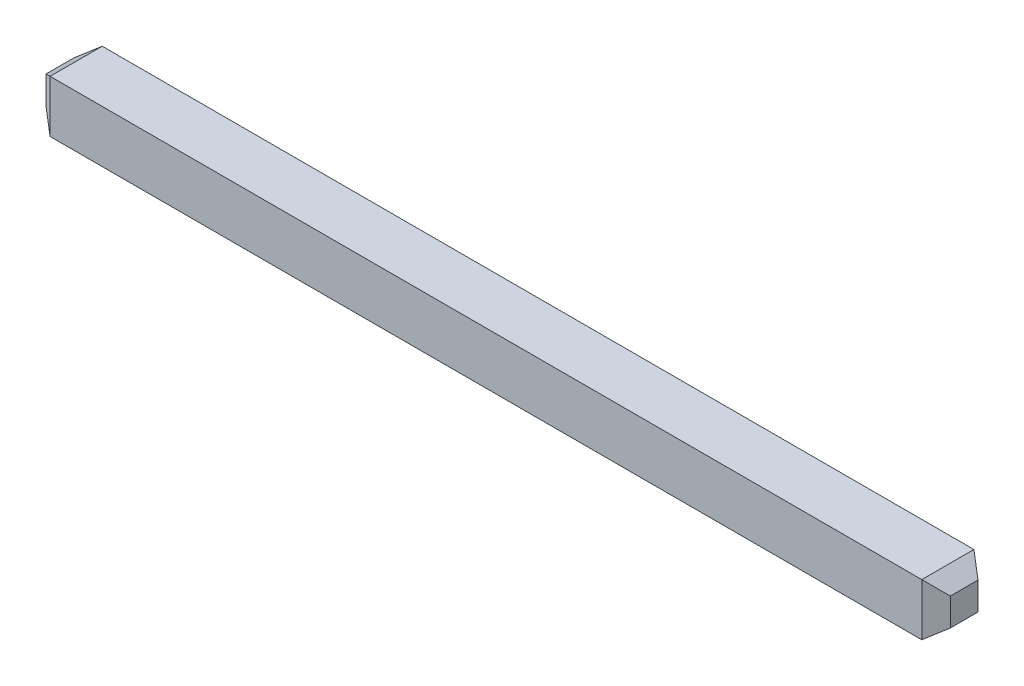
ISO-10303-21;
HEADER;
FILE_DESCRIPTION(('STEP AP214'),'2;1');
FILE_NAME('part.step','',(''),(''),'','','');
FILE_SCHEMA(('AUTOMOTIVE_DESIGN { 1 0 10303 214 1 1 1 1 }'));
ENDSEC;
DATA;
#1=APPLICATION_CONTEXT('core data for automotive mechanical design processes');
#2=APPLICATION_PROTOCOL_DEFINITION('international standard','automotive_design',2000,#1);
#3=PRODUCT_CONTEXT('',#1,'mechanical');
#4=PRODUCT('Part','Part','',(#3));
#5=PRODUCT_RELATED_PRODUCT_CATEGORY('part','',(#4));
#6=PRODUCT_DEFINITION_FORMATION('','',#4);
#7=PRODUCT_DEFINITION_CONTEXT('part definition',#1,'design');
#8=PRODUCT_DEFINITION('design','',#6,#7);
#9=PRODUCT_DEFINITION_SHAPE('','',#8);
#10=(LENGTH_UNIT() NAMED_UNIT(*) SI_UNIT(.MILLI.,.METRE.));
#11=(NAMED_UNIT(*) PLANE_ANGLE_UNIT() SI_UNIT($,.RADIAN.));
#12=(NAMED_UNIT(*) SI_UNIT($,.STERADIAN.) SOLID_ANGLE_UNIT());
#13=UNCERTAINTY_MEASURE_WITH_UNIT(LENGTH_MEASURE(1.E-05),#10,'distance_accuracy_value','');
#14=(GEOMETRIC_REPRESENTATION_CONTEXT(3) GLOBAL_UNCERTAINTY_ASSIGNED_CONTEXT((#13)) GLOBAL_UNIT_ASSIGNED_CONTEXT((#10,
#11,#12)) REPRESENTATION_CONTEXT('',''));
#15=CARTESIAN_POINT('',(0.,0.,0.));
#16=DIRECTION('',(0.,0.,1.));
#17=DIRECTION('',(1.,0.,0.));
#18=AXIS2_PLACEMENT_3D('',#15,#16,#17);
#19=CARTESIAN_POINT('',(-2.4,1.23,-26.915));
#20=DIRECTION('',(0.5999999999908,0.,0.8000000000069));
#21=DIRECTION('',(0.8000000000069,0.,-0.5999999999908));
#22=AXIS2_PLACEMENT_3D('',#19,#20,#21);
#23=PLANE('',#22);
#24=DIRECTION('',(0.,1.,0.));
#25=VECTOR('',#24,1.);
#26=CARTESIAN_POINT('',(-2.3,1.23,-26.99));
#27=LINE('',#26,#25);
#28=CARTESIAN_POINT('',(-2.29999999999957,1.55,-26.9899999999994));
#29=VERTEX_POINT('',#28);
#30=CARTESIAN_POINT('',(-2.29999999999958,0.909999999999898,-26.9899999999994));
#31=VERTEX_POINT('',#30);
#32=EDGE_CURVE('E101',#29,#31,#27,.F.);
#33=ORIENTED_EDGE('',*,*,#32,.T.);
#34=DIRECTION('',(-0.685994340569491,0.51449575542834,0.514495755427438));
#35=VECTOR('',#34,1.);
#36=CARTESIAN_POINT('',(-2.30000000000009,0.909999999999786,-26.99));
#37=LINE('',#36,#35);
#38=CARTESIAN_POINT('',(-2.50000000000021,1.06000000000001,-26.8400000000003));
#39=VERTEX_POINT('',#38);
#40=EDGE_CURVE('E85',#31,#39,#37,.T.);
#41=ORIENTED_EDGE('',*,*,#40,.T.);
#42=DIRECTION('',(0.,1.,0.));
#43=VECTOR('',#42,1.);
#44=CARTESIAN_POINT('',(-2.5,1.23,-26.84));
#45=LINE('',#44,#43);
#46=CARTESIAN_POINT('',(-2.50000000000043,1.4,-26.8400000000006));
#47=VERTEX_POINT('',#46);
#48=EDGE_CURVE('E79',#39,#47,#45,.T.);
#49=ORIENTED_EDGE('',*,*,#48,.T.);
#50=DIRECTION('',(-0.685994340570034,-0.514495755427526,0.514495755427528));
#51=VECTOR('',#50,1.);
#52=CARTESIAN_POINT('',(-2.3,1.55,-26.99));
#53=LINE('',#52,#51);
#54=EDGE_CURVE('E20',#29,#47,#53,.T.);
#55=ORIENTED_EDGE('',*,*,#54,.F.);
#56=EDGE_LOOP('',(#33,#41,#49,#55));
#57=FACE_BOUND('',#56,.T.);
#58=ADVANCED_FACE('F17',(#57),#23,.F.);
#59=CARTESIAN_POINT('',(8.5,1.23,-26.915));
#60=DIRECTION('',(-0.5999999999908,0.,0.8000000000069));
#61=DIRECTION('',(0.8000000000069,0.,0.5999999999908));
#62=AXIS2_PLACEMENT_3D('',#59,#60,#61);
#63=PLANE('',#62);
#64=DIRECTION('',(0.,1.,0.));
#65=VECTOR('',#64,1.);
#66=CARTESIAN_POINT('',(8.6,1.23,-26.84));
#67=LINE('',#66,#65);
#68=CARTESIAN_POINT('',(8.6000000000002,1.06000000000003,-26.8400000000003));
#69=VERTEX_POINT('',#68);
#70=CARTESIAN_POINT('',(8.60000000000043,1.4,-26.8400000000006));
#71=VERTEX_POINT('',#70);
#72=EDGE_CURVE('E113',#69,#71,#67,.T.);
#73=ORIENTED_EDGE('',*,*,#72,.F.);
#74=DIRECTION('',(-0.685994340569492,-0.51449575542834,-0.514495755427437));
#75=VECTOR('',#74,1.);
#76=CARTESIAN_POINT('',(8.59999999999996,1.06000000000005,-26.84));
#77=LINE('',#76,#75);
#78=CARTESIAN_POINT('',(8.39999999999959,0.909999999999884,-26.9899999999994));
#79=VERTEX_POINT('',#78);
#80=EDGE_CURVE('E108',#69,#79,#77,.T.);
#81=ORIENTED_EDGE('',*,*,#80,.T.);
#82=DIRECTION('',(0.,1.,0.));
#83=VECTOR('',#82,1.);
#84=CARTESIAN_POINT('',(8.4,1.23,-26.99));
#85=LINE('',#84,#83);
#86=CARTESIAN_POINT('',(8.39999999999957,1.55,-26.9899999999994));
#87=VERTEX_POINT('',#86);
#88=EDGE_CURVE('E99',#79,#87,#85,.T.);
#89=ORIENTED_EDGE('',*,*,#88,.T.);
#90=DIRECTION('',(-0.685994340570033,0.514495755427525,-0.514495755427531));
#91=VECTOR('',#90,1.);
#92=CARTESIAN_POINT('',(8.6,1.4,-26.84));
#93=LINE('',#92,#91);
#94=EDGE_CURVE('E116',#71,#87,#93,.T.);
#95=ORIENTED_EDGE('',*,*,#94,.F.);
#96=EDGE_LOOP('',(#73,#81,#89,#95));
#97=FACE_BOUND('',#96,.T.);
#98=ADVANCED_FACE('F214',(#97),#63,.F.);
#99=CARTESIAN_POINT('',(-2.4,1.475,-26.67));
#100=DIRECTION('',(-0.6,0.8,0.));
#101=DIRECTION('',(-0.8,-0.6,0.));
#102=AXIS2_PLACEMENT_3D('',#99,#100,#101);
#103=PLANE('',#102);
#104=DIRECTION('',(-0.685994340575992,-0.514495755427529,-0.514495755419582));
#105=VECTOR('',#104,1.);
#106=CARTESIAN_POINT('',(-2.29999999999913,1.55,-26.3500000000012));
#107=LINE('',#106,#105);
#108=CARTESIAN_POINT('',(-2.29999999999989,1.55,-26.3500000000001));
#109=VERTEX_POINT('',#108);
#110=CARTESIAN_POINT('',(-2.50000000000022,1.4,-26.4999999999997));
#111=VERTEX_POINT('',#110);
#112=EDGE_CURVE('E128',#109,#111,#107,.T.);
#113=ORIENTED_EDGE('',*,*,#112,.F.);
#114=DIRECTION('',(0.,0.,1.));
#115=VECTOR('',#114,1.);
#116=CARTESIAN_POINT('',(-2.3,1.55,-26.67));
#117=LINE('',#116,#115);
#118=EDGE_CURVE('E93',#29,#109,#117,.T.);
#119=ORIENTED_EDGE('',*,*,#118,.F.);
#120=ORIENTED_EDGE('',*,*,#54,.T.);
#121=DIRECTION('',(0.,0.,-1.));
#122=VECTOR('',#121,1.);
#123=CARTESIAN_POINT('',(-2.5,1.4,-26.67));
#124=LINE('',#123,#122);
#125=EDGE_CURVE('E87',#47,#111,#124,.F.);
#126=ORIENTED_EDGE('',*,*,#125,.T.);
#127=EDGE_LOOP('',(#113,#119,#120,#126));
#128=FACE_BOUND('',#127,.T.);
#129=ADVANCED_FACE('F90',(#128),#103,.T.);
#130=CARTESIAN_POINT('',(-2.5,1.23,-26.67));
#131=DIRECTION('',(1.,0.,0.));
#132=DIRECTION('',(0.,0.,-1.));
#133=AXIS2_PLACEMENT_3D('',#130,#131,#132);
#134=PLANE('',#133);
#135=DIRECTION('',(0.,1.,0.));
#136=VECTOR('',#135,1.);
#137=CARTESIAN_POINT('',(-2.50000000000087,1.23,-26.4999999999988));
#138=LINE('',#137,#136);
#139=CARTESIAN_POINT('',(-2.50000000000021,1.06000000000001,-26.4999999999997));
#140=VERTEX_POINT('',#139);
#141=EDGE_CURVE('E97',#111,#140,#138,.F.);
#142=ORIENTED_EDGE('',*,*,#141,.F.);
#143=ORIENTED_EDGE('',*,*,#125,.F.);
#144=ORIENTED_EDGE('',*,*,#48,.F.);
#145=DIRECTION('',(0.,0.,1.));
#146=VECTOR('',#145,1.);
#147=CARTESIAN_POINT('',(-2.49999999999996,1.06000000000005,-26.67));
#148=LINE('',#147,#146);
#149=EDGE_CURVE('E105',#39,#140,#148,.T.);
#150=ORIENTED_EDGE('',*,*,#149,.T.);
#151=EDGE_LOOP('',(#142,#143,#144,#150));
#152=FACE_BOUND('',#151,.T.);
#153=ADVANCED_FACE('F95',(#152),#134,.F.);
#154=CARTESIAN_POINT('',(3.05,1.23,-26.99));
#155=DIRECTION('',(0.,0.,1.));
#156=DIRECTION('',(1.,0.,0.));
#157=AXIS2_PLACEMENT_3D('',#154,#155,#156);
#158=PLANE('',#157);
#159=ORIENTED_EDGE('',*,*,#32,.F.);
#160=DIRECTION('',(1.,0.,0.));
#161=VECTOR('',#160,1.);
#162=CARTESIAN_POINT('',(3.05,1.55,-26.99));
#163=LINE('',#162,#161);
#164=EDGE_CURVE('E122',#87,#29,#163,.F.);
#165=ORIENTED_EDGE('',*,*,#164,.F.);
#166=ORIENTED_EDGE('',*,*,#88,.F.);
#167=DIRECTION('',(1.,0.,0.));
#168=VECTOR('',#167,1.);
#169=CARTESIAN_POINT('',(3.05,0.91,-26.99));
#170=LINE('',#169,#168);
#171=EDGE_CURVE('E136',#79,#31,#170,.F.);
#172=ORIENTED_EDGE('',*,*,#171,.T.);
#173=EDGE_LOOP('',(#159,#165,#166,#172));
#174=FACE_BOUND('',#173,.T.);
#175=ADVANCED_FACE('F182',(#174),#158,.F.);
#176=CARTESIAN_POINT('',(-2.4,0.9849999999999,-26.67));
#177=DIRECTION('',(0.600000000000912,0.799999999999316,0.));
#178=DIRECTION('',(-0.799999999999316,0.600000000000912,0.));
#179=AXIS2_PLACEMENT_3D('',#176,#177,#178);
#180=PLANE('',#179);
#181=DIRECTION('',(0.,0.,1.));
#182=VECTOR('',#181,1.);
#183=CARTESIAN_POINT('',(-2.3,0.91,-26.67));
#184=LINE('',#183,#182);
#185=CARTESIAN_POINT('',(-2.29999999999983,0.909999999999856,-26.3500000000003));
#186=VERTEX_POINT('',#185);
#187=EDGE_CURVE('E139',#31,#186,#184,.T.);
#188=ORIENTED_EDGE('',*,*,#187,.T.);
#189=DIRECTION('',(0.68599434057587,-0.514495755427782,0.514495755419491));
#190=VECTOR('',#189,1.);
#191=CARTESIAN_POINT('',(-2.50000000000087,1.06,-26.4999999999988));
#192=LINE('',#191,#190);
#193=EDGE_CURVE('E131',#140,#186,#192,.T.);
#194=ORIENTED_EDGE('',*,*,#193,.F.);
#195=ORIENTED_EDGE('',*,*,#149,.F.);
#196=ORIENTED_EDGE('',*,*,#40,.F.);
#197=EDGE_LOOP('',(#188,#194,#195,#196));
#198=FACE_BOUND('',#197,.T.);
#199=ADVANCED_FACE('F179',(#198),#180,.F.);
#200=CARTESIAN_POINT('',(8.5,0.9849999999999,-26.67));
#201=DIRECTION('',(-0.600000000000912,0.799999999999316,0.));
#202=DIRECTION('',(-0.799999999999316,-0.600000000000912,0.));
#203=AXIS2_PLACEMENT_3D('',#200,#201,#202);
#204=PLANE('',#203);
#205=DIRECTION('',(0.,0.,-1.));
#206=VECTOR('',#205,1.);
#207=CARTESIAN_POINT('',(8.6,1.06,-26.67));
#208=LINE('',#207,#206);
#209=CARTESIAN_POINT('',(8.6000000000002,1.06000000000003,-26.4999999999997));
#210=VERTEX_POINT('',#209);
#211=EDGE_CURVE('E110',#210,#69,#208,.T.);
#212=ORIENTED_EDGE('',*,*,#211,.F.);
#213=DIRECTION('',(0.685994340575871,0.514495755427787,-0.514495755419485));
#214=VECTOR('',#213,1.);
#215=CARTESIAN_POINT('',(8.39999999999913,0.9099999999999,-26.3500000000012));
#216=LINE('',#215,#214);
#217=CARTESIAN_POINT('',(8.39999999999993,0.909999999999868,-26.3500000000001));
#218=VERTEX_POINT('',#217);
#219=EDGE_CURVE('E35',#218,#210,#216,.T.);
#220=ORIENTED_EDGE('',*,*,#219,.F.);
#221=DIRECTION('',(0.,0.,1.));
#222=VECTOR('',#221,1.);
#223=CARTESIAN_POINT('',(8.4,0.91,-26.67));
#224=LINE('',#223,#222);
#225=EDGE_CURVE('E134',#218,#79,#224,.F.);
#226=ORIENTED_EDGE('',*,*,#225,.T.);
#227=ORIENTED_EDGE('',*,*,#80,.F.);
#228=EDGE_LOOP('',(#212,#220,#226,#227));
#229=FACE_BOUND('',#228,.T.);
#230=ADVANCED_FACE('F181',(#229),#204,.F.);
#231=CARTESIAN_POINT('',(8.6,1.23,-26.67));
#232=DIRECTION('',(1.,0.,0.));
#233=DIRECTION('',(0.,0.,-1.));
#234=AXIS2_PLACEMENT_3D('',#231,#232,#233);
#235=PLANE('',#234);
#236=ORIENTED_EDGE('',*,*,#72,.T.);
#237=DIRECTION('',(0.,0.,1.));
#238=VECTOR('',#237,1.);
#239=CARTESIAN_POINT('',(8.6,1.4,-26.67));
#240=LINE('',#239,#238);
#241=CARTESIAN_POINT('',(8.60000000000022,1.4,-26.4999999999997));
#242=VERTEX_POINT('',#241);
#243=EDGE_CURVE('E119',#242,#71,#240,.F.);
#244=ORIENTED_EDGE('',*,*,#243,.F.);
#245=DIRECTION('',(0.,1.,0.));
#246=VECTOR('',#245,1.);
#247=CARTESIAN_POINT('',(8.60000000000087,1.23,-26.4999999999988));
#248=LINE('',#247,#246);
#249=EDGE_CURVE('E142',#210,#242,#248,.T.);
#250=ORIENTED_EDGE('',*,*,#249,.F.);
#251=ORIENTED_EDGE('',*,*,#211,.T.);
#252=EDGE_LOOP('',(#236,#244,#250,#251));
#253=FACE_BOUND('',#252,.T.);
#254=ADVANCED_FACE('F189',(#253),#235,.T.);
#255=CARTESIAN_POINT('',(8.5,1.475,-26.67));
#256=DIRECTION('',(0.6,0.8,0.));
#257=DIRECTION('',(-0.8,0.6,0.));
#258=AXIS2_PLACEMENT_3D('',#255,#256,#257);
#259=PLANE('',#258);
#260=DIRECTION('',(-0.685994340575992,0.514495755427535,0.514495755419576));
#261=VECTOR('',#260,1.);
#262=CARTESIAN_POINT('',(8.60000000000087,1.4,-26.4999999999988));
#263=LINE('',#262,#261);
#264=CARTESIAN_POINT('',(8.39999999999989,1.55,-26.3500000000001));
#265=VERTEX_POINT('',#264);
#266=EDGE_CURVE('E145',#242,#265,#263,.T.);
#267=ORIENTED_EDGE('',*,*,#266,.F.);
#268=ORIENTED_EDGE('',*,*,#243,.T.);
#269=ORIENTED_EDGE('',*,*,#94,.T.);
#270=DIRECTION('',(0.,0.,1.));
#271=VECTOR('',#270,1.);
#272=CARTESIAN_POINT('',(8.4,1.55,-26.67));
#273=LINE('',#272,#271);
#274=EDGE_CURVE('E125',#265,#87,#273,.F.);
#275=ORIENTED_EDGE('',*,*,#274,.F.);
#276=EDGE_LOOP('',(#267,#268,#269,#275));
#277=FACE_BOUND('',#276,.T.);
#278=ADVANCED_FACE('F170',(#277),#259,.T.);
#279=CARTESIAN_POINT('',(3.05,1.55,-26.67));
#280=DIRECTION('',(0.,1.,0.));
#281=DIRECTION('',(0.,0.,1.));
#282=AXIS2_PLACEMENT_3D('',#279,#280,#281);
#283=PLANE('',#282);
#284=DIRECTION('',(1.,0.,0.));
#285=VECTOR('',#284,1.);
#286=CARTESIAN_POINT('',(3.05,1.55,-26.35));
#287=LINE('',#286,#285);
#288=EDGE_CURVE('E148',#265,#109,#287,.F.);
#289=ORIENTED_EDGE('',*,*,#288,.F.);
#290=ORIENTED_EDGE('',*,*,#274,.T.);
#291=ORIENTED_EDGE('',*,*,#164,.T.);
#292=ORIENTED_EDGE('',*,*,#118,.T.);
#293=EDGE_LOOP('',(#289,#290,#291,#292));
#294=FACE_BOUND('',#293,.T.);
#295=ADVANCED_FACE('F173',(#294),#283,.T.);
#296=CARTESIAN_POINT('',(-2.4,1.23,-26.425));
#297=DIRECTION('',(-0.599999999990736,0.,0.800000000006948));
#298=DIRECTION('',(0.800000000006948,0.,0.599999999990736));
#299=AXIS2_PLACEMENT_3D('',#296,#297,#298);
#300=PLANE('',#299);
#301=ORIENTED_EDGE('',*,*,#193,.T.);
#302=DIRECTION('',(0.,1.,0.));
#303=VECTOR('',#302,1.);
#304=CARTESIAN_POINT('',(-2.3,1.23,-26.35));
#305=LINE('',#304,#303);
#306=EDGE_CURVE('E151',#109,#186,#305,.F.);
#307=ORIENTED_EDGE('',*,*,#306,.F.);
#308=ORIENTED_EDGE('',*,*,#112,.T.);
#309=ORIENTED_EDGE('',*,*,#141,.T.);
#310=EDGE_LOOP('',(#301,#307,#308,#309));
#311=FACE_BOUND('',#310,.T.);
#312=ADVANCED_FACE('F176',(#311),#300,.T.);
#313=CARTESIAN_POINT('',(3.05,0.91,-26.67));
#314=DIRECTION('',(0.,1.,0.));
#315=DIRECTION('',(0.,0.,1.));
#316=AXIS2_PLACEMENT_3D('',#313,#314,#315);
#317=PLANE('',#316);
#318=ORIENTED_EDGE('',*,*,#187,.F.);
#319=ORIENTED_EDGE('',*,*,#171,.F.);
#320=ORIENTED_EDGE('',*,*,#225,.F.);
#321=DIRECTION('',(1.,0.,0.));
#322=VECTOR('',#321,1.);
#323=CARTESIAN_POINT('',(3.05,0.9099999999999,-26.35));
#324=LINE('',#323,#322);
#325=EDGE_CURVE('E26',#186,#218,#324,.T.);
#326=ORIENTED_EDGE('',*,*,#325,.F.);
#327=EDGE_LOOP('',(#318,#319,#320,#326));
#328=FACE_BOUND('',#327,.T.);
#329=ADVANCED_FACE('F162',(#328),#317,.F.);
#330=CARTESIAN_POINT('',(8.5,1.23,-26.425));
#331=DIRECTION('',(0.599999999990736,0.,0.800000000006948));
#332=DIRECTION('',(0.800000000006948,0.,-0.599999999990736));
#333=AXIS2_PLACEMENT_3D('',#330,#331,#332);
#334=PLANE('',#333);
#335=ORIENTED_EDGE('',*,*,#266,.T.);
#336=DIRECTION('',(0.,1.,0.));
#337=VECTOR('',#336,1.);
#338=CARTESIAN_POINT('',(8.4,1.23,-26.35));
#339=LINE('',#338,#337);
#340=EDGE_CURVE('E11',#218,#265,#339,.T.);
#341=ORIENTED_EDGE('',*,*,#340,.F.);
#342=ORIENTED_EDGE('',*,*,#219,.T.);
#343=ORIENTED_EDGE('',*,*,#249,.T.);
#344=EDGE_LOOP('',(#335,#341,#342,#343));
#345=FACE_BOUND('',#344,.T.);
#346=ADVANCED_FACE('F166',(#345),#334,.T.);
#347=CARTESIAN_POINT('',(3.05,1.23,-26.35));
#348=DIRECTION('',(0.,0.,1.));
#349=DIRECTION('',(1.,0.,0.));
#350=AXIS2_PLACEMENT_3D('',#347,#348,#349);
#351=PLANE('',#350);
#352=ORIENTED_EDGE('',*,*,#325,.T.);
#353=ORIENTED_EDGE('',*,*,#340,.T.);
#354=ORIENTED_EDGE('',*,*,#288,.T.);
#355=ORIENTED_EDGE('',*,*,#306,.T.);
#356=EDGE_LOOP('',(#352,#353,#354,#355));
#357=FACE_BOUND('',#356,.T.);
#358=ADVANCED_FACE('F157',(#357),#351,.T.);
#359=CLOSED_SHELL('',(#58,#98,#129,#153,#175,#199,#230,#254,#278,#295,#312,#329,#346,#358));
#360=MANIFOLD_SOLID_BREP('B1',#359);
#361=ADVANCED_BREP_SHAPE_REPRESENTATION('',(#18,#360),#14);
#362=SHAPE_DEFINITION_REPRESENTATION(#9,#361);
ENDSEC;
END-ISO-10303-21;
